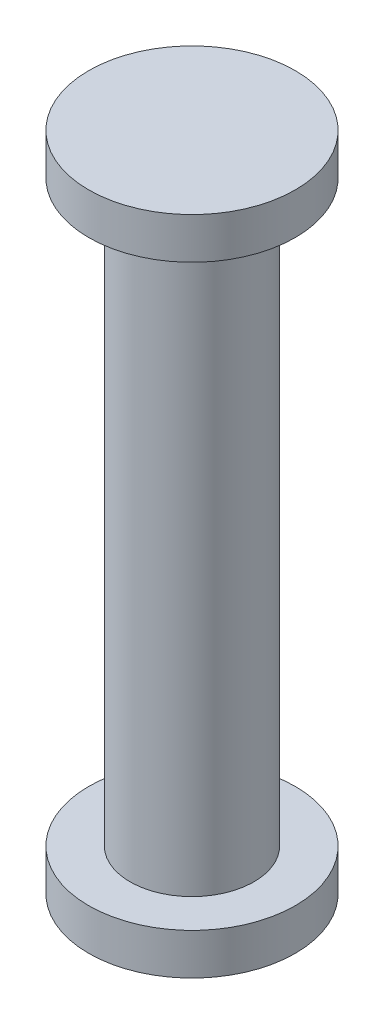
ISO-10303-21;
HEADER;
FILE_DESCRIPTION(('STEP AP214'),'2;1');
FILE_NAME('part.step','',(''),(''),'','','');
FILE_SCHEMA(('AUTOMOTIVE_DESIGN { 1 0 10303 214 1 1 1 1 }'));
ENDSEC;
DATA;
#1=APPLICATION_CONTEXT('core data for automotive mechanical design processes');
#2=APPLICATION_PROTOCOL_DEFINITION('international standard','automotive_design',2000,#1);
#3=PRODUCT_CONTEXT('',#1,'mechanical');
#4=PRODUCT('Part','Part','',(#3));
#5=PRODUCT_RELATED_PRODUCT_CATEGORY('part','',(#4));
#6=PRODUCT_DEFINITION_FORMATION('','',#4);
#7=PRODUCT_DEFINITION_CONTEXT('part definition',#1,'design');
#8=PRODUCT_DEFINITION('design','',#6,#7);
#9=PRODUCT_DEFINITION_SHAPE('','',#8);
#10=(LENGTH_UNIT() NAMED_UNIT(*) SI_UNIT(.MILLI.,.METRE.));
#11=(NAMED_UNIT(*) PLANE_ANGLE_UNIT() SI_UNIT($,.RADIAN.));
#12=(NAMED_UNIT(*) SI_UNIT($,.STERADIAN.) SOLID_ANGLE_UNIT());
#13=UNCERTAINTY_MEASURE_WITH_UNIT(LENGTH_MEASURE(1.E-05),#10,'distance_accuracy_value','');
#14=(GEOMETRIC_REPRESENTATION_CONTEXT(3) GLOBAL_UNCERTAINTY_ASSIGNED_CONTEXT((#13)) GLOBAL_UNIT_ASSIGNED_CONTEXT((#10,
#11,#12)) REPRESENTATION_CONTEXT('',''));
#15=CARTESIAN_POINT('',(0.,0.,0.));
#16=DIRECTION('',(0.,0.,1.));
#17=DIRECTION('',(1.,0.,0.));
#18=AXIS2_PLACEMENT_3D('',#15,#16,#17);
#19=CARTESIAN_POINT('',(-2.5,0.,0.));
#20=DIRECTION('',(0.,1.,0.));
#21=DIRECTION('',(0.,0.,1.));
#22=AXIS2_PLACEMENT_3D('',#19,#20,#21);
#23=PLANE('',#22);
#24=CARTESIAN_POINT('',(0.,0.,0.));
#25=DIRECTION('',(0.,-1.,0.));
#26=DIRECTION('',(0.,0.,-1.));
#27=AXIS2_PLACEMENT_3D('',#24,#25,#26);
#28=CIRCLE('',#27,2.5);
#29=CARTESIAN_POINT('',(0.,0.,-2.5));
#30=VERTEX_POINT('',#29);
#31=EDGE_CURVE('E64',#30,#30,#28,.T.);
#32=ORIENTED_EDGE('',*,*,#31,.T.);
#33=EDGE_LOOP('',(#32));
#34=FACE_BOUND('',#33,.T.);
#35=ADVANCED_FACE('F37',(#34),#23,.F.);
#36=CARTESIAN_POINT('',(0.,16.,0.));
#37=DIRECTION('',(0.,-1.,0.));
#38=DIRECTION('',(0.,0.,-1.));
#39=AXIS2_PLACEMENT_3D('',#36,#37,#38);
#40=PLANE('',#39);
#41=CARTESIAN_POINT('',(0.,16.,0.));
#42=DIRECTION('',(0.,-1.,0.));
#43=DIRECTION('',(0.,0.,-1.));
#44=AXIS2_PLACEMENT_3D('',#41,#42,#43);
#45=CIRCLE('',#44,2.5);
#46=CARTESIAN_POINT('',(0.,16.,-2.5));
#47=VERTEX_POINT('',#46);
#48=EDGE_CURVE('E10',#47,#47,#45,.T.);
#49=ORIENTED_EDGE('',*,*,#48,.F.);
#50=EDGE_LOOP('',(#49));
#51=FACE_BOUND('',#50,.T.);
#52=ADVANCED_FACE('F95',(#51),#40,.F.);
#53=CARTESIAN_POINT('',(0.,0.,0.));
#54=DIRECTION('',(0.,-1.,0.));
#55=DIRECTION('',(0.,0.,-1.));
#56=AXIS2_PLACEMENT_3D('',#53,#54,#55);
#57=CYLINDRICAL_SURFACE('',#56,2.5);
#58=CARTESIAN_POINT('',(0.,15.,0.));
#59=DIRECTION('',(0.,-1.,0.));
#60=DIRECTION('',(0.,0.,-1.));
#61=AXIS2_PLACEMENT_3D('',#58,#59,#60);
#62=CIRCLE('',#61,2.5);
#63=CARTESIAN_POINT('',(0.,15.,-2.5));
#64=VERTEX_POINT('',#63);
#65=EDGE_CURVE('E44',#64,#64,#62,.T.);
#66=ORIENTED_EDGE('',*,*,#65,.F.);
#67=EDGE_LOOP('',(#66));
#68=FACE_BOUND('',#67,.T.);
#69=ORIENTED_EDGE('',*,*,#48,.T.);
#70=EDGE_LOOP('',(#69));
#71=FACE_BOUND('',#70,.T.);
#72=ADVANCED_FACE('F90',(#68,#71),#57,.T.);
#73=CARTESIAN_POINT('',(-2.5,15.,0.));
#74=DIRECTION('',(0.,1.,0.));
#75=DIRECTION('',(0.,0.,1.));
#76=AXIS2_PLACEMENT_3D('',#73,#74,#75);
#77=PLANE('',#76);
#78=CARTESIAN_POINT('',(0.,15.,0.));
#79=DIRECTION('',(0.,-1.,0.));
#80=DIRECTION('',(0.,0.,-1.));
#81=AXIS2_PLACEMENT_3D('',#78,#79,#80);
#82=CIRCLE('',#81,1.5);
#83=CARTESIAN_POINT('',(0.,15.,-1.5));
#84=VERTEX_POINT('',#83);
#85=EDGE_CURVE('E49',#84,#84,#82,.T.);
#86=ORIENTED_EDGE('',*,*,#85,.F.);
#87=EDGE_LOOP('',(#86));
#88=FACE_BOUND('',#87,.T.);
#89=ORIENTED_EDGE('',*,*,#65,.T.);
#90=EDGE_LOOP('',(#89));
#91=FACE_BOUND('',#90,.T.);
#92=ADVANCED_FACE('F85',(#88,#91),#77,.F.);
#93=CARTESIAN_POINT('',(0.,0.,0.));
#94=DIRECTION('',(0.,-1.,0.));
#95=DIRECTION('',(0.,0.,-1.));
#96=AXIS2_PLACEMENT_3D('',#93,#94,#95);
#97=CYLINDRICAL_SURFACE('',#96,1.5);
#98=CARTESIAN_POINT('',(0.,1.,0.));
#99=DIRECTION('',(0.,-1.,0.));
#100=DIRECTION('',(0.,0.,-1.));
#101=AXIS2_PLACEMENT_3D('',#98,#99,#100);
#102=CIRCLE('',#101,1.5);
#103=CARTESIAN_POINT('',(0.,1.,-1.5));
#104=VERTEX_POINT('',#103);
#105=EDGE_CURVE('E54',#104,#104,#102,.T.);
#106=ORIENTED_EDGE('',*,*,#105,.F.);
#107=EDGE_LOOP('',(#106));
#108=FACE_BOUND('',#107,.T.);
#109=ORIENTED_EDGE('',*,*,#85,.T.);
#110=EDGE_LOOP('',(#109));
#111=FACE_BOUND('',#110,.T.);
#112=ADVANCED_FACE('F79',(#108,#111),#97,.T.);
#113=CARTESIAN_POINT('',(-1.5,1.,0.));
#114=DIRECTION('',(0.,-1.,0.));
#115=DIRECTION('',(0.,0.,-1.));
#116=AXIS2_PLACEMENT_3D('',#113,#114,#115);
#117=PLANE('',#116);
#118=CARTESIAN_POINT('',(0.,1.,0.));
#119=DIRECTION('',(0.,-1.,0.));
#120=DIRECTION('',(0.,0.,-1.));
#121=AXIS2_PLACEMENT_3D('',#118,#119,#120);
#122=CIRCLE('',#121,2.5);
#123=CARTESIAN_POINT('',(0.,1.,-2.5));
#124=VERTEX_POINT('',#123);
#125=EDGE_CURVE('E60',#124,#124,#122,.T.);
#126=ORIENTED_EDGE('',*,*,#125,.F.);
#127=EDGE_LOOP('',(#126));
#128=FACE_BOUND('',#127,.T.);
#129=ORIENTED_EDGE('',*,*,#105,.T.);
#130=EDGE_LOOP('',(#129));
#131=FACE_BOUND('',#130,.T.);
#132=ADVANCED_FACE('F73',(#128,#131),#117,.F.);
#133=CARTESIAN_POINT('',(0.,0.,0.));
#134=DIRECTION('',(0.,-1.,0.));
#135=DIRECTION('',(0.,0.,-1.));
#136=AXIS2_PLACEMENT_3D('',#133,#134,#135);
#137=CYLINDRICAL_SURFACE('',#136,2.5);
#138=ORIENTED_EDGE('',*,*,#31,.F.);
#139=EDGE_LOOP('',(#138));
#140=FACE_BOUND('',#139,.T.);
#141=ORIENTED_EDGE('',*,*,#125,.T.);
#142=EDGE_LOOP('',(#141));
#143=FACE_BOUND('',#142,.T.);
#144=ADVANCED_FACE('F70',(#140,#143),#137,.T.);
#145=CLOSED_SHELL('',(#35,#52,#72,#92,#112,#132,#144));
#146=MANIFOLD_SOLID_BREP('B2',#145);
#147=ADVANCED_BREP_SHAPE_REPRESENTATION('',(#18,#146),#14);
#148=SHAPE_DEFINITION_REPRESENTATION(#9,#147);
ENDSEC;
END-ISO-10303-21;
